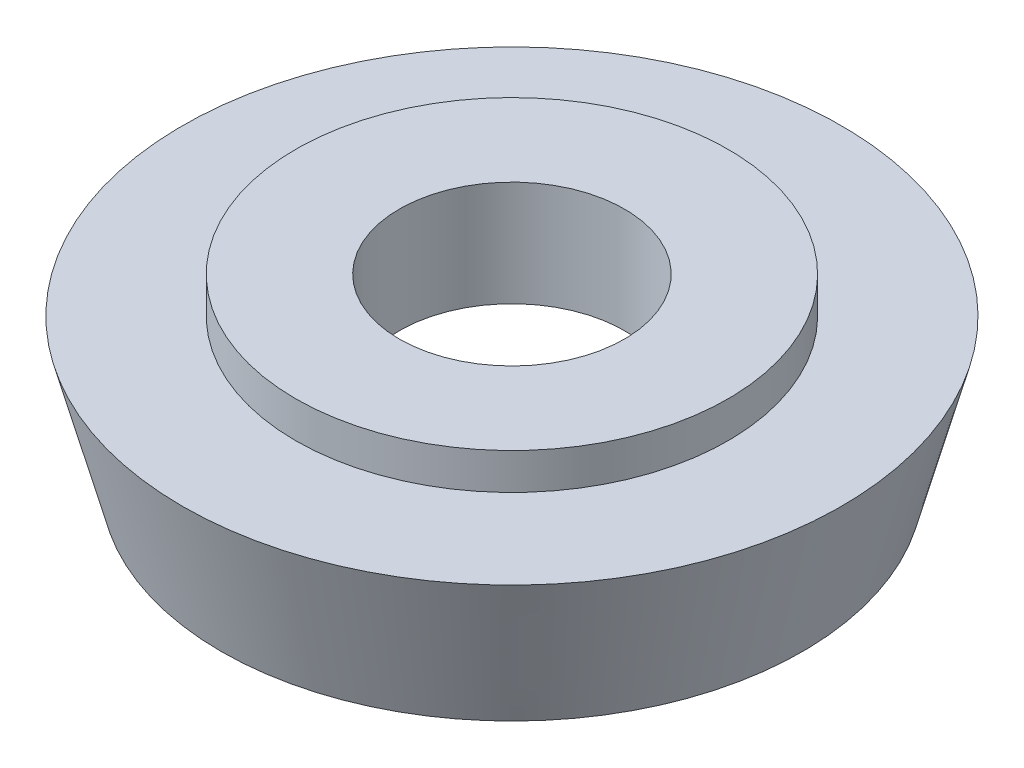
ISO-10303-21;
HEADER;
FILE_DESCRIPTION(('STEP AP214'),'2;1');
FILE_NAME('part.step','',(''),(''),'','','');
FILE_SCHEMA(('AUTOMOTIVE_DESIGN { 1 0 10303 214 1 1 1 1 }'));
ENDSEC;
DATA;
#1=APPLICATION_CONTEXT('core data for automotive mechanical design processes');
#2=APPLICATION_PROTOCOL_DEFINITION('international standard','automotive_design',2000,#1);
#3=PRODUCT_CONTEXT('',#1,'mechanical');
#4=PRODUCT('Part','Part','',(#3));
#5=PRODUCT_RELATED_PRODUCT_CATEGORY('part','',(#4));
#6=PRODUCT_DEFINITION_FORMATION('','',#4);
#7=PRODUCT_DEFINITION_CONTEXT('part definition',#1,'design');
#8=PRODUCT_DEFINITION('design','',#6,#7);
#9=PRODUCT_DEFINITION_SHAPE('','',#8);
#10=(LENGTH_UNIT() NAMED_UNIT(*) SI_UNIT(.MILLI.,.METRE.));
#11=(NAMED_UNIT(*) PLANE_ANGLE_UNIT() SI_UNIT($,.RADIAN.));
#12=(NAMED_UNIT(*) SI_UNIT($,.STERADIAN.) SOLID_ANGLE_UNIT());
#13=UNCERTAINTY_MEASURE_WITH_UNIT(LENGTH_MEASURE(1.E-05),#10,'distance_accuracy_value','');
#14=(GEOMETRIC_REPRESENTATION_CONTEXT(3) GLOBAL_UNCERTAINTY_ASSIGNED_CONTEXT((#13)) GLOBAL_UNIT_ASSIGNED_CONTEXT((#10,
#11,#12)) REPRESENTATION_CONTEXT('',''));
#15=CARTESIAN_POINT('',(0.,0.,0.));
#16=DIRECTION('',(0.,0.,1.));
#17=DIRECTION('',(1.,0.,0.));
#18=AXIS2_PLACEMENT_3D('',#15,#16,#17);
#19=CARTESIAN_POINT('',(0.,2.5,0.));
#20=DIRECTION('',(0.,1.,0.));
#21=DIRECTION('',(0.,0.,1.));
#22=AXIS2_PLACEMENT_3D('',#19,#20,#21);
#23=CYLINDRICAL_SURFACE('',#22,2.975);
#24=CARTESIAN_POINT('',(0.,2.,0.));
#25=DIRECTION('',(0.,1.,0.));
#26=DIRECTION('',(0.,0.,1.));
#27=AXIS2_PLACEMENT_3D('',#24,#25,#26);
#28=CIRCLE('',#27,2.975);
#29=CARTESIAN_POINT('',(0.,2.,2.975));
#30=VERTEX_POINT('',#29);
#31=EDGE_CURVE('E59',#30,#30,#28,.T.);
#32=ORIENTED_EDGE('',*,*,#31,.T.);
#33=EDGE_LOOP('',(#32));
#34=FACE_BOUND('',#33,.T.);
#35=CARTESIAN_POINT('',(0.,2.5,0.));
#36=DIRECTION('',(0.,1.,0.));
#37=DIRECTION('',(0.,0.,1.));
#38=AXIS2_PLACEMENT_3D('',#35,#36,#37);
#39=CIRCLE('',#38,2.975);
#40=CARTESIAN_POINT('',(0.,2.5,2.975));
#41=VERTEX_POINT('',#40);
#42=EDGE_CURVE('E10',#41,#41,#39,.T.);
#43=ORIENTED_EDGE('',*,*,#42,.F.);
#44=EDGE_LOOP('',(#43));
#45=FACE_BOUND('',#44,.T.);
#46=ADVANCED_FACE('F31',(#34,#45),#23,.T.);
#47=CARTESIAN_POINT('',(-1.55,2.5,0.));
#48=DIRECTION('',(0.,1.,0.));
#49=DIRECTION('',(0.,0.,1.));
#50=AXIS2_PLACEMENT_3D('',#47,#48,#49);
#51=PLANE('',#50);
#52=ORIENTED_EDGE('',*,*,#42,.T.);
#53=EDGE_LOOP('',(#52));
#54=FACE_BOUND('',#53,.T.);
#55=CARTESIAN_POINT('',(0.,2.5,0.));
#56=DIRECTION('',(0.,1.,0.));
#57=DIRECTION('',(0.,0.,1.));
#58=AXIS2_PLACEMENT_3D('',#55,#56,#57);
#59=CIRCLE('',#58,1.55);
#60=CARTESIAN_POINT('',(0.,2.5,1.55));
#61=VERTEX_POINT('',#60);
#62=EDGE_CURVE('E37',#61,#61,#59,.T.);
#63=ORIENTED_EDGE('',*,*,#62,.F.);
#64=EDGE_LOOP('',(#63));
#65=FACE_BOUND('',#64,.T.);
#66=ADVANCED_FACE('F77',(#54,#65),#51,.T.);
#67=CARTESIAN_POINT('',(0.,2.5,0.));
#68=DIRECTION('',(0.,1.,0.));
#69=DIRECTION('',(0.,0.,1.));
#70=AXIS2_PLACEMENT_3D('',#67,#68,#69);
#71=CYLINDRICAL_SURFACE('',#70,1.55);
#72=ORIENTED_EDGE('',*,*,#62,.T.);
#73=EDGE_LOOP('',(#72));
#74=FACE_BOUND('',#73,.T.);
#75=CARTESIAN_POINT('',(0.,1.05,0.));
#76=DIRECTION('',(0.,1.,0.));
#77=DIRECTION('',(0.,0.,1.));
#78=AXIS2_PLACEMENT_3D('',#75,#76,#77);
#79=CIRCLE('',#78,1.55);
#80=CARTESIAN_POINT('',(0.,1.05,1.55));
#81=VERTEX_POINT('',#80);
#82=EDGE_CURVE('E41',#81,#81,#79,.T.);
#83=ORIENTED_EDGE('',*,*,#82,.F.);
#84=EDGE_LOOP('',(#83));
#85=FACE_BOUND('',#84,.T.);
#86=ADVANCED_FACE('F81',(#74,#85),#71,.F.);
#87=CARTESIAN_POINT('',(-3.05,1.05,0.));
#88=DIRECTION('',(0.,-1.,0.));
#89=DIRECTION('',(0.,0.,-1.));
#90=AXIS2_PLACEMENT_3D('',#87,#88,#89);
#91=PLANE('',#90);
#92=ORIENTED_EDGE('',*,*,#82,.T.);
#93=EDGE_LOOP('',(#92));
#94=FACE_BOUND('',#93,.T.);
#95=CARTESIAN_POINT('',(0.,1.05,0.));
#96=DIRECTION('',(0.,1.,0.));
#97=DIRECTION('',(0.,0.,1.));
#98=AXIS2_PLACEMENT_3D('',#95,#96,#97);
#99=CIRCLE('',#98,3.05);
#100=CARTESIAN_POINT('',(0.,1.05,3.05));
#101=VERTEX_POINT('',#100);
#102=EDGE_CURVE('E45',#101,#101,#99,.T.);
#103=ORIENTED_EDGE('',*,*,#102,.F.);
#104=EDGE_LOOP('',(#103));
#105=FACE_BOUND('',#104,.T.);
#106=ADVANCED_FACE('F85',(#94,#105),#91,.T.);
#107=CARTESIAN_POINT('',(0.,2.5,0.));
#108=DIRECTION('',(0.,1.,0.));
#109=DIRECTION('',(0.,0.,1.));
#110=AXIS2_PLACEMENT_3D('',#107,#108,#109);
#111=CYLINDRICAL_SURFACE('',#110,3.05);
#112=ORIENTED_EDGE('',*,*,#102,.T.);
#113=EDGE_LOOP('',(#112));
#114=FACE_BOUND('',#113,.T.);
#115=CARTESIAN_POINT('',(0.,0.,0.));
#116=DIRECTION('',(0.,1.,0.));
#117=DIRECTION('',(0.,0.,1.));
#118=AXIS2_PLACEMENT_3D('',#115,#116,#117);
#119=CIRCLE('',#118,3.05);
#120=CARTESIAN_POINT('',(0.,0.,3.05));
#121=VERTEX_POINT('',#120);
#122=EDGE_CURVE('E50',#121,#121,#119,.T.);
#123=ORIENTED_EDGE('',*,*,#122,.F.);
#124=EDGE_LOOP('',(#123));
#125=FACE_BOUND('',#124,.T.);
#126=ADVANCED_FACE('F91',(#114,#125),#111,.F.);
#127=CARTESIAN_POINT('',(-4.,0.,0.));
#128=DIRECTION('',(0.,-1.,0.));
#129=DIRECTION('',(0.,0.,-1.));
#130=AXIS2_PLACEMENT_3D('',#127,#128,#129);
#131=PLANE('',#130);
#132=ORIENTED_EDGE('',*,*,#122,.T.);
#133=EDGE_LOOP('',(#132));
#134=FACE_BOUND('',#133,.T.);
#135=CARTESIAN_POINT('',(0.,0.,0.));
#136=DIRECTION('',(0.,1.,0.));
#137=DIRECTION('',(0.,0.,1.));
#138=AXIS2_PLACEMENT_3D('',#135,#136,#137);
#139=CIRCLE('',#138,4.);
#140=CARTESIAN_POINT('',(0.,0.,4.));
#141=VERTEX_POINT('',#140);
#142=EDGE_CURVE('E53',#141,#141,#139,.T.);
#143=ORIENTED_EDGE('',*,*,#142,.F.);
#144=EDGE_LOOP('',(#143));
#145=FACE_BOUND('',#144,.T.);
#146=ADVANCED_FACE('F73',(#134,#145),#131,.T.);
#147=CARTESIAN_POINT('',(0.,2.,0.));
#148=DIRECTION('',(0.,1.,0.));
#149=DIRECTION('',(0.,0.,1.));
#150=AXIS2_PLACEMENT_3D('',#147,#148,#149);
#151=CONICAL_SURFACE('',#150,4.53589838486225,0.26179938779915);
#152=ORIENTED_EDGE('',*,*,#142,.T.);
#153=EDGE_LOOP('',(#152));
#154=FACE_BOUND('',#153,.T.);
#155=CARTESIAN_POINT('',(0.,2.,0.));
#156=DIRECTION('',(0.,1.,0.));
#157=DIRECTION('',(0.,0.,1.));
#158=AXIS2_PLACEMENT_3D('',#155,#156,#157);
#159=CIRCLE('',#158,4.53589838486225);
#160=CARTESIAN_POINT('',(0.,2.,4.53589838486225));
#161=VERTEX_POINT('',#160);
#162=EDGE_CURVE('E56',#161,#161,#159,.T.);
#163=ORIENTED_EDGE('',*,*,#162,.F.);
#164=EDGE_LOOP('',(#163));
#165=FACE_BOUND('',#164,.T.);
#166=ADVANCED_FACE('F67',(#154,#165),#151,.T.);
#167=CARTESIAN_POINT('',(-2.975,2.,0.));
#168=DIRECTION('',(0.,1.,0.));
#169=DIRECTION('',(0.,0.,1.));
#170=AXIS2_PLACEMENT_3D('',#167,#168,#169);
#171=PLANE('',#170);
#172=ORIENTED_EDGE('',*,*,#162,.T.);
#173=EDGE_LOOP('',(#172));
#174=FACE_BOUND('',#173,.T.);
#175=ORIENTED_EDGE('',*,*,#31,.F.);
#176=EDGE_LOOP('',(#175));
#177=FACE_BOUND('',#176,.T.);
#178=ADVANCED_FACE('F65',(#174,#177),#171,.T.);
#179=CLOSED_SHELL('',(#46,#66,#86,#106,#126,#146,#166,#178));
#180=MANIFOLD_SOLID_BREP('B2',#179);
#181=ADVANCED_BREP_SHAPE_REPRESENTATION('',(#18,#180),#14);
#182=SHAPE_DEFINITION_REPRESENTATION(#9,#181);
ENDSEC;
END-ISO-10303-21;
